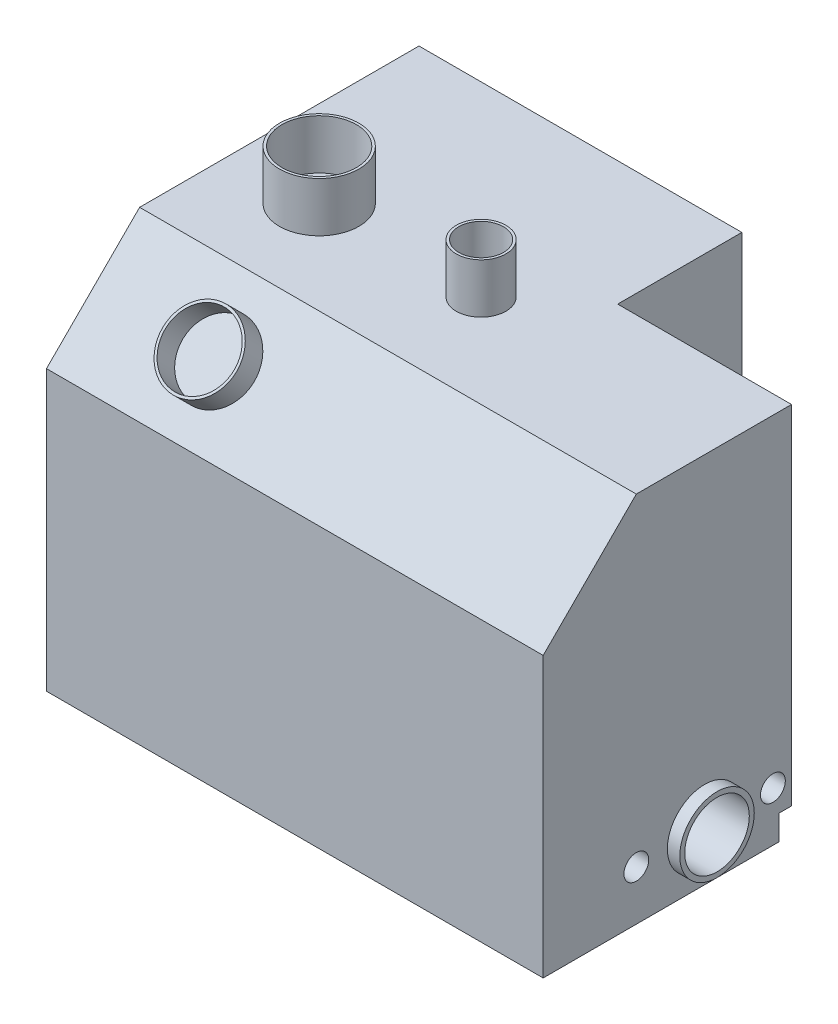
ISO-10303-21;
HEADER;
FILE_DESCRIPTION(('STEP AP214'),'2;1');
FILE_NAME('part.step','',(''),(''),'','','');
FILE_SCHEMA(('AUTOMOTIVE_DESIGN { 1 0 10303 214 1 1 1 1 }'));
ENDSEC;
DATA;
#1=APPLICATION_CONTEXT('core data for automotive mechanical design processes');
#2=APPLICATION_PROTOCOL_DEFINITION('international standard','automotive_design',2000,#1);
#3=PRODUCT_CONTEXT('',#1,'mechanical');
#4=PRODUCT('Part','Part','',(#3));
#5=PRODUCT_RELATED_PRODUCT_CATEGORY('part','',(#4));
#6=PRODUCT_DEFINITION_FORMATION('','',#4);
#7=PRODUCT_DEFINITION_CONTEXT('part definition',#1,'design');
#8=PRODUCT_DEFINITION('design','',#6,#7);
#9=PRODUCT_DEFINITION_SHAPE('','',#8);
#10=(LENGTH_UNIT() NAMED_UNIT(*) SI_UNIT(.MILLI.,.METRE.));
#11=(NAMED_UNIT(*) PLANE_ANGLE_UNIT() SI_UNIT($,.RADIAN.));
#12=(NAMED_UNIT(*) SI_UNIT($,.STERADIAN.) SOLID_ANGLE_UNIT());
#13=UNCERTAINTY_MEASURE_WITH_UNIT(LENGTH_MEASURE(1.E-05),#10,'distance_accuracy_value','');
#14=(GEOMETRIC_REPRESENTATION_CONTEXT(3) GLOBAL_UNCERTAINTY_ASSIGNED_CONTEXT((#13)) GLOBAL_UNIT_ASSIGNED_CONTEXT((#10,
#11,#12)) REPRESENTATION_CONTEXT('',''));
#15=CARTESIAN_POINT('',(0.,0.,0.));
#16=DIRECTION('',(0.,0.,1.));
#17=DIRECTION('',(1.,0.,0.));
#18=AXIS2_PLACEMENT_3D('',#15,#16,#17);
#19=CARTESIAN_POINT('',(-100.,150.,75.));
#20=DIRECTION('',(1.,0.,0.));
#21=DIRECTION('',(0.,0.,-1.));
#22=AXIS2_PLACEMENT_3D('',#19,#20,#21);
#23=PLANE('',#22);
#24=DIRECTION('',(0.,-1.,0.));
#25=VECTOR('',#24,1.);
#26=CARTESIAN_POINT('',(-100.,150.,75.));
#27=LINE('',#26,#25);
#28=CARTESIAN_POINT('',(-100.,112.499999999999,75.));
#29=VERTEX_POINT('',#28);
#30=CARTESIAN_POINT('',(-100.,0.,75.));
#31=VERTEX_POINT('',#30);
#32=EDGE_CURVE('E149',#29,#31,#27,.T.);
#33=ORIENTED_EDGE('',*,*,#32,.F.);
#34=DIRECTION('',(0.,0.707106781186554,-0.707106781186541));
#35=VECTOR('',#34,1.);
#36=CARTESIAN_POINT('',(-100.,150.,37.5));
#37=LINE('',#36,#35);
#38=CARTESIAN_POINT('',(-100.,150.,37.5));
#39=VERTEX_POINT('',#38);
#40=EDGE_CURVE('E200',#29,#39,#37,.T.);
#41=ORIENTED_EDGE('',*,*,#40,.T.);
#42=DIRECTION('',(0.,0.,1.));
#43=VECTOR('',#42,1.);
#44=CARTESIAN_POINT('',(-100.,150.,75.));
#45=LINE('',#44,#43);
#46=CARTESIAN_POINT('',(-100.,150.,-75.));
#47=VERTEX_POINT('',#46);
#48=EDGE_CURVE('E132',#47,#39,#45,.T.);
#49=ORIENTED_EDGE('',*,*,#48,.F.);
#50=DIRECTION('',(0.,-1.,0.));
#51=VECTOR('',#50,1.);
#52=CARTESIAN_POINT('',(-100.,150.,-75.));
#53=LINE('',#52,#51);
#54=CARTESIAN_POINT('',(-100.,0.,-75.));
#55=VERTEX_POINT('',#54);
#56=EDGE_CURVE('E126',#47,#55,#53,.T.);
#57=ORIENTED_EDGE('',*,*,#56,.T.);
#58=DIRECTION('',(0.,0.,1.));
#59=VECTOR('',#58,1.);
#60=CARTESIAN_POINT('',(-100.,0.,75.));
#61=LINE('',#60,#59);
#62=EDGE_CURVE('E136',#55,#31,#61,.T.);
#63=ORIENTED_EDGE('',*,*,#62,.T.);
#64=EDGE_LOOP('',(#33,#41,#49,#57,#63));
#65=FACE_BOUND('',#64,.T.);
#66=ADVANCED_FACE('F34',(#65),#23,.F.);
#67=CARTESIAN_POINT('',(100.,150.,75.));
#68=DIRECTION('',(0.,0.,-1.));
#69=DIRECTION('',(-1.,0.,0.));
#70=AXIS2_PLACEMENT_3D('',#67,#68,#69);
#71=PLANE('',#70);
#72=DIRECTION('',(0.,-1.,0.));
#73=VECTOR('',#72,1.);
#74=CARTESIAN_POINT('',(100.,150.,75.));
#75=LINE('',#74,#73);
#76=CARTESIAN_POINT('',(100.,112.499999999999,75.));
#77=VERTEX_POINT('',#76);
#78=CARTESIAN_POINT('',(100.,0.,75.));
#79=VERTEX_POINT('',#78);
#80=EDGE_CURVE('E130',#77,#79,#75,.T.);
#81=ORIENTED_EDGE('',*,*,#80,.F.);
#82=DIRECTION('',(1.,0.,0.));
#83=VECTOR('',#82,1.);
#84=CARTESIAN_POINT('',(-100.,112.499999999999,75.));
#85=LINE('',#84,#83);
#86=EDGE_CURVE('E206',#29,#77,#85,.T.);
#87=ORIENTED_EDGE('',*,*,#86,.F.);
#88=ORIENTED_EDGE('',*,*,#32,.T.);
#89=DIRECTION('',(1.,0.,0.));
#90=VECTOR('',#89,1.);
#91=CARTESIAN_POINT('',(100.,0.,75.));
#92=LINE('',#91,#90);
#93=EDGE_CURVE('E139',#31,#79,#92,.T.);
#94=ORIENTED_EDGE('',*,*,#93,.T.);
#95=EDGE_LOOP('',(#81,#87,#88,#94));
#96=FACE_BOUND('',#95,.T.);
#97=ADVANCED_FACE('F191',(#96),#71,.F.);
#98=CARTESIAN_POINT('',(100.,150.,75.));
#99=DIRECTION('',(-1.,0.,0.));
#100=DIRECTION('',(0.,0.,1.));
#101=AXIS2_PLACEMENT_3D('',#98,#99,#100);
#102=PLANE('',#101);
#103=CARTESIAN_POINT('',(100.,20.,-17.5));
#104=DIRECTION('',(1.,0.,0.));
#105=DIRECTION('',(0.,0.,1.));
#106=AXIS2_PLACEMENT_3D('',#103,#104,#105);
#107=CIRCLE('',#106,5.);
#108=CARTESIAN_POINT('',(100.,20.,-12.5));
#109=VERTEX_POINT('',#108);
#110=EDGE_CURVE('E235',#109,#109,#107,.T.);
#111=ORIENTED_EDGE('',*,*,#110,.F.);
#112=EDGE_LOOP('',(#111));
#113=FACE_BOUND('',#112,.T.);
#114=CARTESIAN_POINT('',(100.,20.,37.5));
#115=DIRECTION('',(1.,0.,0.));
#116=DIRECTION('',(0.,0.,-1.));
#117=AXIS2_PLACEMENT_3D('',#114,#115,#116);
#118=CIRCLE('',#117,5.);
#119=CARTESIAN_POINT('',(100.,20.,32.5));
#120=VERTEX_POINT('',#119);
#121=EDGE_CURVE('E229',#120,#120,#118,.T.);
#122=ORIENTED_EDGE('',*,*,#121,.F.);
#123=EDGE_LOOP('',(#122));
#124=FACE_BOUND('',#123,.T.);
#125=CARTESIAN_POINT('',(100.,20.,9.99999999999998));
#126=DIRECTION('',(-1.,0.,0.));
#127=DIRECTION('',(0.,0.,1.));
#128=AXIS2_PLACEMENT_3D('',#125,#126,#127);
#129=CIRCLE('',#128,15.);
#130=CARTESIAN_POINT('',(100.,20.,25.));
#131=VERTEX_POINT('',#130);
#132=EDGE_CURVE('E151',#131,#131,#129,.F.);
#133=ORIENTED_EDGE('',*,*,#132,.F.);
#134=EDGE_LOOP('',(#133));
#135=FACE_BOUND('',#134,.T.);
#136=DIRECTION('',(0.,0.,1.));
#137=VECTOR('',#136,1.);
#138=CARTESIAN_POINT('',(100.,10.,-75.));
#139=LINE('',#138,#137);
#140=CARTESIAN_POINT('',(100.,10.,-25.));
#141=VERTEX_POINT('',#140);
#142=CARTESIAN_POINT('',(100.,10.,-20.));
#143=VERTEX_POINT('',#142);
#144=EDGE_CURVE('E223',#141,#143,#139,.T.);
#145=ORIENTED_EDGE('',*,*,#144,.F.);
#146=DIRECTION('',(0.,1.,0.));
#147=VECTOR('',#146,1.);
#148=CARTESIAN_POINT('',(100.,0.,-25.));
#149=LINE('',#148,#147);
#150=CARTESIAN_POINT('',(100.,150.,-25.));
#151=VERTEX_POINT('',#150);
#152=EDGE_CURVE('E311',#141,#151,#149,.T.);
#153=ORIENTED_EDGE('',*,*,#152,.T.);
#154=DIRECTION('',(0.,0.,-1.));
#155=VECTOR('',#154,1.);
#156=CARTESIAN_POINT('',(100.,150.,75.));
#157=LINE('',#156,#155);
#158=CARTESIAN_POINT('',(100.,150.,37.5));
#159=VERTEX_POINT('',#158);
#160=EDGE_CURVE('E128',#159,#151,#157,.T.);
#161=ORIENTED_EDGE('',*,*,#160,.F.);
#162=DIRECTION('',(0.,0.707106781186554,-0.707106781186541));
#163=VECTOR('',#162,1.);
#164=CARTESIAN_POINT('',(100.,150.,37.5));
#165=LINE('',#164,#163);
#166=EDGE_CURVE('E56',#77,#159,#165,.T.);
#167=ORIENTED_EDGE('',*,*,#166,.F.);
#168=ORIENTED_EDGE('',*,*,#80,.T.);
#169=DIRECTION('',(0.,0.,-1.));
#170=VECTOR('',#169,1.);
#171=CARTESIAN_POINT('',(100.,0.,75.));
#172=LINE('',#171,#170);
#173=CARTESIAN_POINT('',(100.,0.,-20.));
#174=VERTEX_POINT('',#173);
#175=EDGE_CURVE('E143',#79,#174,#172,.T.);
#176=ORIENTED_EDGE('',*,*,#175,.T.);
#177=DIRECTION('',(0.,-1.,0.));
#178=VECTOR('',#177,1.);
#179=CARTESIAN_POINT('',(100.,0.,-20.));
#180=LINE('',#179,#178);
#181=EDGE_CURVE('E113',#143,#174,#180,.T.);
#182=ORIENTED_EDGE('',*,*,#181,.F.);
#183=EDGE_LOOP('',(#145,#153,#161,#167,#168,#176,#182));
#184=FACE_BOUND('',#183,.T.);
#185=ADVANCED_FACE('F196',(#113,#124,#135,#184),#102,.F.);
#186=CARTESIAN_POINT('',(100.,150.,-75.));
#187=DIRECTION('',(0.,0.,1.));
#188=DIRECTION('',(1.,0.,0.));
#189=AXIS2_PLACEMENT_3D('',#186,#187,#188);
#190=PLANE('',#189);
#191=DIRECTION('',(-1.,0.,0.));
#192=VECTOR('',#191,1.);
#193=CARTESIAN_POINT('',(100.,150.,-75.));
#194=LINE('',#193,#192);
#195=CARTESIAN_POINT('',(30.,150.,-75.));
#196=VERTEX_POINT('',#195);
#197=EDGE_CURVE('E119',#196,#47,#194,.T.);
#198=ORIENTED_EDGE('',*,*,#197,.F.);
#199=DIRECTION('',(0.,1.,0.));
#200=VECTOR('',#199,1.);
#201=CARTESIAN_POINT('',(30.,10.,-75.));
#202=LINE('',#201,#200);
#203=CARTESIAN_POINT('',(30.,0.,-75.));
#204=VERTEX_POINT('',#203);
#205=EDGE_CURVE('E102',#204,#196,#202,.T.);
#206=ORIENTED_EDGE('',*,*,#205,.F.);
#207=DIRECTION('',(-1.,0.,0.));
#208=VECTOR('',#207,1.);
#209=CARTESIAN_POINT('',(100.,0.,-75.));
#210=LINE('',#209,#208);
#211=EDGE_CURVE('E146',#204,#55,#210,.T.);
#212=ORIENTED_EDGE('',*,*,#211,.T.);
#213=ORIENTED_EDGE('',*,*,#56,.F.);
#214=EDGE_LOOP('',(#198,#206,#212,#213));
#215=FACE_BOUND('',#214,.T.);
#216=ADVANCED_FACE('F124',(#215),#190,.F.);
#217=CARTESIAN_POINT('',(0.,150.,0.));
#218=DIRECTION('',(0.,1.,0.));
#219=DIRECTION('',(0.,0.,1.));
#220=AXIS2_PLACEMENT_3D('',#217,#218,#219);
#221=PLANE('',#220);
#222=DIRECTION('',(1.,0.,0.));
#223=VECTOR('',#222,1.);
#224=CARTESIAN_POINT('',(100.,150.,-25.));
#225=LINE('',#224,#223);
#226=CARTESIAN_POINT('',(30.,150.,-25.));
#227=VERTEX_POINT('',#226);
#228=EDGE_CURVE('E122',#227,#151,#225,.T.);
#229=ORIENTED_EDGE('',*,*,#228,.F.);
#230=DIRECTION('',(0.,0.,1.));
#231=VECTOR('',#230,1.);
#232=CARTESIAN_POINT('',(30.,150.,-75.));
#233=LINE('',#232,#231);
#234=EDGE_CURVE('E105',#196,#227,#233,.T.);
#235=ORIENTED_EDGE('',*,*,#234,.F.);
#236=ORIENTED_EDGE('',*,*,#197,.T.);
#237=ORIENTED_EDGE('',*,*,#48,.T.);
#238=DIRECTION('',(1.,0.,0.));
#239=VECTOR('',#238,1.);
#240=CARTESIAN_POINT('',(-100.,150.,37.5));
#241=LINE('',#240,#239);
#242=EDGE_CURVE('E221',#39,#159,#241,.T.);
#243=ORIENTED_EDGE('',*,*,#242,.T.);
#244=ORIENTED_EDGE('',*,*,#160,.T.);
#245=EDGE_LOOP('',(#229,#235,#236,#237,#243,#244));
#246=FACE_BOUND('',#245,.T.);
#247=CARTESIAN_POINT('',(-65.1960375674245,150.,0.));
#248=DIRECTION('',(0.,1.,0.));
#249=DIRECTION('',(0.,0.,1.));
#250=AXIS2_PLACEMENT_3D('',#247,#248,#249);
#251=CIRCLE('',#250,16.);
#252=CARTESIAN_POINT('',(-65.1960375674245,150.,16.));
#253=VERTEX_POINT('',#252);
#254=EDGE_CURVE('E303',#253,#253,#251,.T.);
#255=ORIENTED_EDGE('',*,*,#254,.F.);
#256=EDGE_LOOP('',(#255));
#257=FACE_BOUND('',#256,.T.);
#258=CARTESIAN_POINT('',(0.,150.,0.));
#259=DIRECTION('',(0.,1.,0.));
#260=DIRECTION('',(0.,0.,1.));
#261=AXIS2_PLACEMENT_3D('',#258,#259,#260);
#262=CIRCLE('',#261,10.);
#263=CARTESIAN_POINT('',(0.,150.,10.));
#264=VERTEX_POINT('',#263);
#265=EDGE_CURVE('E294',#264,#264,#262,.T.);
#266=ORIENTED_EDGE('',*,*,#265,.F.);
#267=EDGE_LOOP('',(#266));
#268=FACE_BOUND('',#267,.T.);
#269=ADVANCED_FACE('F116',(#246,#257,#268),#221,.T.);
#270=CARTESIAN_POINT('',(0.,0.,0.));
#271=DIRECTION('',(0.,1.,0.));
#272=DIRECTION('',(0.,0.,1.));
#273=AXIS2_PLACEMENT_3D('',#270,#271,#272);
#274=PLANE('',#273);
#275=DIRECTION('',(0.,0.,-1.));
#276=VECTOR('',#275,1.);
#277=CARTESIAN_POINT('',(30.,0.,0.));
#278=LINE('',#277,#276);
#279=CARTESIAN_POINT('',(30.,0.,-20.));
#280=VERTEX_POINT('',#279);
#281=EDGE_CURVE('E108',#280,#204,#278,.T.);
#282=ORIENTED_EDGE('',*,*,#281,.F.);
#283=DIRECTION('',(1.,0.,0.));
#284=VECTOR('',#283,1.);
#285=CARTESIAN_POINT('',(0.,0.,-20.));
#286=LINE('',#285,#284);
#287=EDGE_CURVE('E155',#280,#174,#286,.T.);
#288=ORIENTED_EDGE('',*,*,#287,.T.);
#289=ORIENTED_EDGE('',*,*,#175,.F.);
#290=ORIENTED_EDGE('',*,*,#93,.F.);
#291=ORIENTED_EDGE('',*,*,#62,.F.);
#292=ORIENTED_EDGE('',*,*,#211,.F.);
#293=EDGE_LOOP('',(#282,#288,#289,#290,#291,#292));
#294=FACE_BOUND('',#293,.T.);
#295=ADVANCED_FACE('F189',(#294),#274,.F.);
#296=CARTESIAN_POINT('',(105.,20.,9.99999999999998));
#297=DIRECTION('',(1.,0.,0.));
#298=DIRECTION('',(0.,0.,-1.));
#299=AXIS2_PLACEMENT_3D('',#296,#297,#298);
#300=PLANE('',#299);
#301=CARTESIAN_POINT('',(105.,20.,9.99999999999998));
#302=DIRECTION('',(1.,0.,0.));
#303=DIRECTION('',(0.,0.,-1.));
#304=AXIS2_PLACEMENT_3D('',#301,#302,#303);
#305=CIRCLE('',#304,15.);
#306=CARTESIAN_POINT('',(105.,20.,-5.00000000000002));
#307=VERTEX_POINT('',#306);
#308=EDGE_CURVE('E140',#307,#307,#305,.T.);
#309=ORIENTED_EDGE('',*,*,#308,.T.);
#310=EDGE_LOOP('',(#309));
#311=FACE_BOUND('',#310,.T.);
#312=CARTESIAN_POINT('',(105.,20.,9.99999999999998));
#313=DIRECTION('',(1.,0.,0.));
#314=DIRECTION('',(0.,0.,-1.));
#315=AXIS2_PLACEMENT_3D('',#312,#313,#314);
#316=CIRCLE('',#315,13.);
#317=CARTESIAN_POINT('',(105.,20.,-3.00000000000002));
#318=VERTEX_POINT('',#317);
#319=EDGE_CURVE('E248',#318,#318,#316,.T.);
#320=ORIENTED_EDGE('',*,*,#319,.F.);
#321=EDGE_LOOP('',(#320));
#322=FACE_BOUND('',#321,.T.);
#323=ADVANCED_FACE('F337',(#311,#322),#300,.T.);
#324=CARTESIAN_POINT('',(105.,20.,9.99999999999998));
#325=DIRECTION('',(-1.,0.,0.));
#326=DIRECTION('',(0.,0.,1.));
#327=AXIS2_PLACEMENT_3D('',#324,#325,#326);
#328=CYLINDRICAL_SURFACE('',#327,15.);
#329=ORIENTED_EDGE('',*,*,#308,.F.);
#330=EDGE_LOOP('',(#329));
#331=FACE_BOUND('',#330,.T.);
#332=ORIENTED_EDGE('',*,*,#132,.T.);
#333=EDGE_LOOP('',(#332));
#334=FACE_BOUND('',#333,.T.);
#335=ADVANCED_FACE('F329',(#331,#334),#328,.T.);
#336=CARTESIAN_POINT('',(105.,20.,9.99999999999998));
#337=DIRECTION('',(-1.,0.,0.));
#338=DIRECTION('',(0.,0.,1.));
#339=AXIS2_PLACEMENT_3D('',#336,#337,#338);
#340=CYLINDRICAL_SURFACE('',#339,13.);
#341=ORIENTED_EDGE('',*,*,#319,.T.);
#342=EDGE_LOOP('',(#341));
#343=FACE_BOUND('',#342,.T.);
#344=CARTESIAN_POINT('',(30.,20.,9.99999999999998));
#345=DIRECTION('',(1.,0.,0.));
#346=DIRECTION('',(0.,0.,-1.));
#347=AXIS2_PLACEMENT_3D('',#344,#345,#346);
#348=CIRCLE('',#347,13.);
#349=CARTESIAN_POINT('',(30.,20.,-3.00000000000002));
#350=VERTEX_POINT('',#349);
#351=EDGE_CURVE('E228',#350,#350,#348,.T.);
#352=ORIENTED_EDGE('',*,*,#351,.F.);
#353=EDGE_LOOP('',(#352));
#354=FACE_BOUND('',#353,.T.);
#355=ADVANCED_FACE('F322',(#343,#354),#340,.F.);
#356=CARTESIAN_POINT('',(30.,0.,-20.));
#357=DIRECTION('',(0.,0.,1.));
#358=DIRECTION('',(0.,-1.,0.));
#359=AXIS2_PLACEMENT_3D('',#356,#357,#358);
#360=PLANE('',#359);
#361=DIRECTION('',(0.,-1.,0.));
#362=VECTOR('',#361,1.);
#363=CARTESIAN_POINT('',(30.,10.,-20.));
#364=LINE('',#363,#362);
#365=CARTESIAN_POINT('',(30.,10.,-20.));
#366=VERTEX_POINT('',#365);
#367=EDGE_CURVE('E240',#366,#280,#364,.T.);
#368=ORIENTED_EDGE('',*,*,#367,.F.);
#369=DIRECTION('',(1.,0.,0.));
#370=VECTOR('',#369,1.);
#371=CARTESIAN_POINT('',(30.,10.,-20.));
#372=LINE('',#371,#370);
#373=EDGE_CURVE('E237',#366,#143,#372,.T.);
#374=ORIENTED_EDGE('',*,*,#373,.T.);
#375=ORIENTED_EDGE('',*,*,#181,.T.);
#376=ORIENTED_EDGE('',*,*,#287,.F.);
#377=EDGE_LOOP('',(#368,#374,#375,#376));
#378=FACE_BOUND('',#377,.T.);
#379=ADVANCED_FACE('F320',(#378),#360,.F.);
#380=CARTESIAN_POINT('',(30.,0.,0.));
#381=DIRECTION('',(1.,0.,0.));
#382=DIRECTION('',(0.,0.,-1.));
#383=AXIS2_PLACEMENT_3D('',#380,#381,#382);
#384=PLANE('',#383);
#385=ORIENTED_EDGE('',*,*,#281,.T.);
#386=ORIENTED_EDGE('',*,*,#205,.T.);
#387=ORIENTED_EDGE('',*,*,#234,.T.);
#388=DIRECTION('',(0.,1.,0.));
#389=VECTOR('',#388,1.);
#390=CARTESIAN_POINT('',(30.,0.,-25.));
#391=LINE('',#390,#389);
#392=CARTESIAN_POINT('',(30.,10.,-25.));
#393=VERTEX_POINT('',#392);
#394=EDGE_CURVE('E48',#393,#227,#391,.T.);
#395=ORIENTED_EDGE('',*,*,#394,.F.);
#396=DIRECTION('',(0.,0.,1.));
#397=VECTOR('',#396,1.);
#398=CARTESIAN_POINT('',(30.,10.,-75.));
#399=LINE('',#398,#397);
#400=EDGE_CURVE('E112',#393,#366,#399,.T.);
#401=ORIENTED_EDGE('',*,*,#400,.T.);
#402=ORIENTED_EDGE('',*,*,#367,.T.);
#403=EDGE_LOOP('',(#385,#386,#387,#395,#401,#402));
#404=FACE_BOUND('',#403,.T.);
#405=ADVANCED_FACE('F104',(#404),#384,.T.);
#406=CARTESIAN_POINT('',(30.,10.,-75.));
#407=DIRECTION('',(0.,1.,0.));
#408=DIRECTION('',(0.,0.,1.));
#409=AXIS2_PLACEMENT_3D('',#406,#407,#408);
#410=PLANE('',#409);
#411=ORIENTED_EDGE('',*,*,#400,.F.);
#412=DIRECTION('',(1.,0.,0.));
#413=VECTOR('',#412,1.);
#414=CARTESIAN_POINT('',(30.,10.,-25.));
#415=LINE('',#414,#413);
#416=EDGE_CURVE('E11',#393,#141,#415,.T.);
#417=ORIENTED_EDGE('',*,*,#416,.T.);
#418=ORIENTED_EDGE('',*,*,#144,.T.);
#419=ORIENTED_EDGE('',*,*,#373,.F.);
#420=EDGE_LOOP('',(#411,#417,#418,#419));
#421=FACE_BOUND('',#420,.T.);
#422=ADVANCED_FACE('F317',(#421),#410,.F.);
#423=CARTESIAN_POINT('',(30.,20.,37.5));
#424=DIRECTION('',(1.,0.,0.));
#425=DIRECTION('',(0.,0.,-1.));
#426=AXIS2_PLACEMENT_3D('',#423,#424,#425);
#427=CYLINDRICAL_SURFACE('',#426,5.);
#428=CARTESIAN_POINT('',(30.,20.,37.5));
#429=DIRECTION('',(1.,0.,0.));
#430=DIRECTION('',(0.,0.,-1.));
#431=AXIS2_PLACEMENT_3D('',#428,#429,#430);
#432=CIRCLE('',#431,5.);
#433=CARTESIAN_POINT('',(30.,20.,32.5));
#434=VERTEX_POINT('',#433);
#435=EDGE_CURVE('E225',#434,#434,#432,.T.);
#436=ORIENTED_EDGE('',*,*,#435,.F.);
#437=EDGE_LOOP('',(#436));
#438=FACE_BOUND('',#437,.T.);
#439=ORIENTED_EDGE('',*,*,#121,.T.);
#440=EDGE_LOOP('',(#439));
#441=FACE_BOUND('',#440,.T.);
#442=ADVANCED_FACE('F335',(#438,#441),#427,.F.);
#443=CARTESIAN_POINT('',(30.,20.,37.5));
#444=DIRECTION('',(1.,0.,0.));
#445=DIRECTION('',(0.,0.,-1.));
#446=AXIS2_PLACEMENT_3D('',#443,#444,#445);
#447=PLANE('',#446);
#448=ORIENTED_EDGE('',*,*,#435,.T.);
#449=EDGE_LOOP('',(#448));
#450=FACE_BOUND('',#449,.T.);
#451=ADVANCED_FACE('F393',(#450),#447,.T.);
#452=CARTESIAN_POINT('',(30.,20.,-17.5));
#453=DIRECTION('',(1.,0.,0.));
#454=DIRECTION('',(0.,0.,-1.));
#455=AXIS2_PLACEMENT_3D('',#452,#453,#454);
#456=CYLINDRICAL_SURFACE('',#455,5.);
#457=CARTESIAN_POINT('',(30.,20.,-17.5));
#458=DIRECTION('',(1.,0.,0.));
#459=DIRECTION('',(0.,0.,1.));
#460=AXIS2_PLACEMENT_3D('',#457,#458,#459);
#461=CIRCLE('',#460,5.);
#462=CARTESIAN_POINT('',(30.,20.,-12.5));
#463=VERTEX_POINT('',#462);
#464=EDGE_CURVE('E232',#463,#463,#461,.T.);
#465=ORIENTED_EDGE('',*,*,#464,.F.);
#466=EDGE_LOOP('',(#465));
#467=FACE_BOUND('',#466,.T.);
#468=ORIENTED_EDGE('',*,*,#110,.T.);
#469=EDGE_LOOP('',(#468));
#470=FACE_BOUND('',#469,.T.);
#471=ADVANCED_FACE('F404',(#467,#470),#456,.F.);
#472=CARTESIAN_POINT('',(30.,20.,-17.5));
#473=DIRECTION('',(-1.,0.,0.));
#474=DIRECTION('',(0.,0.,1.));
#475=AXIS2_PLACEMENT_3D('',#472,#473,#474);
#476=PLANE('',#475);
#477=ORIENTED_EDGE('',*,*,#464,.T.);
#478=EDGE_LOOP('',(#477));
#479=FACE_BOUND('',#478,.T.);
#480=ADVANCED_FACE('F266',(#479),#476,.F.);
#481=CARTESIAN_POINT('',(30.,20.,9.99999999999998));
#482=DIRECTION('',(1.,0.,0.));
#483=DIRECTION('',(0.,0.,-1.));
#484=AXIS2_PLACEMENT_3D('',#481,#482,#483);
#485=PLANE('',#484);
#486=ORIENTED_EDGE('',*,*,#351,.T.);
#487=EDGE_LOOP('',(#486));
#488=FACE_BOUND('',#487,.T.);
#489=ADVANCED_FACE('F255',(#488),#485,.T.);
#490=CARTESIAN_POINT('',(-100.,150.,37.5));
#491=DIRECTION('',(0.,-0.707106781186541,-0.707106781186554));
#492=DIRECTION('',(0.,0.707106781186554,-0.707106781186541));
#493=AXIS2_PLACEMENT_3D('',#490,#491,#492);
#494=PLANE('',#493);
#495=CARTESIAN_POINT('',(-50.,131.249999999999,56.2500000000004));
#496=DIRECTION('',(0.,-0.707106781186541,-0.707106781186554));
#497=DIRECTION('',(0.,0.707106781186554,-0.707106781186541));
#498=AXIS2_PLACEMENT_3D('',#495,#496,#497);
#499=CIRCLE('',#498,15.);
#500=CARTESIAN_POINT('',(-50.,141.856601717798,45.6433982822023));
#501=VERTEX_POINT('',#500);
#502=EDGE_CURVE('E158',#501,#501,#499,.F.);
#503=ORIENTED_EDGE('',*,*,#502,.F.);
#504=EDGE_LOOP('',(#503));
#505=FACE_BOUND('',#504,.T.);
#506=ORIENTED_EDGE('',*,*,#166,.T.);
#507=ORIENTED_EDGE('',*,*,#242,.F.);
#508=ORIENTED_EDGE('',*,*,#40,.F.);
#509=ORIENTED_EDGE('',*,*,#86,.T.);
#510=EDGE_LOOP('',(#506,#507,#508,#509));
#511=FACE_BOUND('',#510,.T.);
#512=ADVANCED_FACE('F252',(#505,#511),#494,.F.);
#513=CARTESIAN_POINT('',(-50.,138.321067811865,63.321067811866));
#514=DIRECTION('',(0.,0.707106781186542,0.707106781186554));
#515=DIRECTION('',(0.,-0.707106781186554,0.707106781186542));
#516=AXIS2_PLACEMENT_3D('',#513,#514,#515);
#517=PLANE('',#516);
#518=CARTESIAN_POINT('',(-50.,138.321067811865,63.321067811866));
#519=DIRECTION('',(0.,0.707106781186542,0.707106781186554));
#520=DIRECTION('',(0.,-0.707106781186554,0.707106781186542));
#521=AXIS2_PLACEMENT_3D('',#518,#519,#520);
#522=CIRCLE('',#521,15.);
#523=CARTESIAN_POINT('',(-50.,127.714466094066,73.9276695296641));
#524=VERTEX_POINT('',#523);
#525=EDGE_CURVE('E214',#524,#524,#522,.T.);
#526=ORIENTED_EDGE('',*,*,#525,.T.);
#527=EDGE_LOOP('',(#526));
#528=FACE_BOUND('',#527,.T.);
#529=CARTESIAN_POINT('',(-50.,138.321067811865,63.321067811866));
#530=DIRECTION('',(0.,0.707106781186542,0.707106781186554));
#531=DIRECTION('',(0.,-0.707106781186554,0.707106781186542));
#532=AXIS2_PLACEMENT_3D('',#529,#530,#531);
#533=CIRCLE('',#532,14.);
#534=CARTESIAN_POINT('',(-50.,128.421572875253,73.2205627484776));
#535=VERTEX_POINT('',#534);
#536=EDGE_CURVE('E218',#535,#535,#533,.T.);
#537=ORIENTED_EDGE('',*,*,#536,.F.);
#538=EDGE_LOOP('',(#537));
#539=FACE_BOUND('',#538,.T.);
#540=ADVANCED_FACE('F254',(#528,#539),#517,.T.);
#541=CARTESIAN_POINT('',(-50.,138.321067811865,63.321067811866));
#542=DIRECTION('',(0.,-0.707106781186542,-0.707106781186554));
#543=DIRECTION('',(0.,0.707106781186554,-0.707106781186542));
#544=AXIS2_PLACEMENT_3D('',#541,#542,#543);
#545=CYLINDRICAL_SURFACE('',#544,15.);
#546=ORIENTED_EDGE('',*,*,#525,.F.);
#547=EDGE_LOOP('',(#546));
#548=FACE_BOUND('',#547,.T.);
#549=ORIENTED_EDGE('',*,*,#502,.T.);
#550=EDGE_LOOP('',(#549));
#551=FACE_BOUND('',#550,.T.);
#552=ADVANCED_FACE('F263',(#548,#551),#545,.T.);
#553=CARTESIAN_POINT('',(-50.,138.321067811865,63.321067811866));
#554=DIRECTION('',(0.,-0.707106781186542,-0.707106781186554));
#555=DIRECTION('',(0.,0.707106781186554,-0.707106781186542));
#556=AXIS2_PLACEMENT_3D('',#553,#554,#555);
#557=CYLINDRICAL_SURFACE('',#556,14.);
#558=ORIENTED_EDGE('',*,*,#536,.T.);
#559=EDGE_LOOP('',(#558));
#560=FACE_BOUND('',#559,.T.);
#561=CARTESIAN_POINT('',(-50.,131.249999999999,56.2500000000005));
#562=DIRECTION('',(0.,0.707106781186542,0.707106781186554));
#563=DIRECTION('',(0.,-0.707106781186554,0.707106781186542));
#564=AXIS2_PLACEMENT_3D('',#561,#562,#563);
#565=CIRCLE('',#564,14.);
#566=CARTESIAN_POINT('',(-50.,121.350505063387,66.149494936612));
#567=VERTEX_POINT('',#566);
#568=EDGE_CURVE('E287',#567,#567,#565,.T.);
#569=ORIENTED_EDGE('',*,*,#568,.F.);
#570=EDGE_LOOP('',(#569));
#571=FACE_BOUND('',#570,.T.);
#572=ADVANCED_FACE('F274',(#560,#571),#557,.F.);
#573=ORIENTED_EDGE('',*,*,#568,.T.);
#574=EDGE_LOOP('',(#573));
#575=FACE_BOUND('',#574,.T.);
#576=ADVANCED_FACE('F258',(#575),#494,.F.);
#577=CARTESIAN_POINT('',(0.,170.,0.));
#578=DIRECTION('',(0.,1.,0.));
#579=DIRECTION('',(0.,0.,1.));
#580=AXIS2_PLACEMENT_3D('',#577,#578,#579);
#581=PLANE('',#580);
#582=CARTESIAN_POINT('',(0.,170.,0.));
#583=DIRECTION('',(0.,1.,0.));
#584=DIRECTION('',(0.,0.,1.));
#585=AXIS2_PLACEMENT_3D('',#582,#583,#584);
#586=CIRCLE('',#585,10.);
#587=CARTESIAN_POINT('',(0.,170.,10.));
#588=VERTEX_POINT('',#587);
#589=EDGE_CURVE('E289',#588,#588,#586,.T.);
#590=ORIENTED_EDGE('',*,*,#589,.T.);
#591=EDGE_LOOP('',(#590));
#592=FACE_BOUND('',#591,.T.);
#593=CARTESIAN_POINT('',(0.,170.,0.));
#594=DIRECTION('',(0.,1.,0.));
#595=DIRECTION('',(0.,0.,1.));
#596=AXIS2_PLACEMENT_3D('',#593,#594,#595);
#597=CIRCLE('',#596,9.);
#598=CARTESIAN_POINT('',(0.,170.,9.));
#599=VERTEX_POINT('',#598);
#600=EDGE_CURVE('E298',#599,#599,#597,.T.);
#601=ORIENTED_EDGE('',*,*,#600,.F.);
#602=EDGE_LOOP('',(#601));
#603=FACE_BOUND('',#602,.T.);
#604=ADVANCED_FACE('F273',(#592,#603),#581,.T.);
#605=CARTESIAN_POINT('',(0.,170.,0.));
#606=DIRECTION('',(0.,-1.,0.));
#607=DIRECTION('',(0.,0.,-1.));
#608=AXIS2_PLACEMENT_3D('',#605,#606,#607);
#609=CYLINDRICAL_SURFACE('',#608,10.);
#610=ORIENTED_EDGE('',*,*,#589,.F.);
#611=EDGE_LOOP('',(#610));
#612=FACE_BOUND('',#611,.T.);
#613=ORIENTED_EDGE('',*,*,#265,.T.);
#614=EDGE_LOOP('',(#613));
#615=FACE_BOUND('',#614,.T.);
#616=ADVANCED_FACE('F280',(#612,#615),#609,.T.);
#617=CARTESIAN_POINT('',(0.,170.,0.));
#618=DIRECTION('',(0.,-1.,0.));
#619=DIRECTION('',(0.,0.,-1.));
#620=AXIS2_PLACEMENT_3D('',#617,#618,#619);
#621=CYLINDRICAL_SURFACE('',#620,9.);
#622=ORIENTED_EDGE('',*,*,#600,.T.);
#623=EDGE_LOOP('',(#622));
#624=FACE_BOUND('',#623,.T.);
#625=CARTESIAN_POINT('',(0.,150.,0.));
#626=DIRECTION('',(0.,1.,0.));
#627=DIRECTION('',(0.,0.,1.));
#628=AXIS2_PLACEMENT_3D('',#625,#626,#627);
#629=CIRCLE('',#628,9.);
#630=CARTESIAN_POINT('',(0.,150.,9.));
#631=VERTEX_POINT('',#630);
#632=EDGE_CURVE('E161',#631,#631,#629,.F.);
#633=ORIENTED_EDGE('',*,*,#632,.T.);
#634=EDGE_LOOP('',(#633));
#635=FACE_BOUND('',#634,.T.);
#636=ADVANCED_FACE('F186',(#624,#635),#621,.F.);
#637=ORIENTED_EDGE('',*,*,#632,.F.);
#638=EDGE_LOOP('',(#637));
#639=FACE_BOUND('',#638,.T.);
#640=ADVANCED_FACE('F172',(#639),#221,.T.);
#641=CARTESIAN_POINT('',(-65.1960375674245,170.,0.));
#642=DIRECTION('',(0.,1.,0.));
#643=DIRECTION('',(0.,0.,1.));
#644=AXIS2_PLACEMENT_3D('',#641,#642,#643);
#645=PLANE('',#644);
#646=CARTESIAN_POINT('',(-65.1960375674245,170.,0.));
#647=DIRECTION('',(0.,1.,0.));
#648=DIRECTION('',(0.,0.,1.));
#649=AXIS2_PLACEMENT_3D('',#646,#647,#648);
#650=CIRCLE('',#649,16.);
#651=CARTESIAN_POINT('',(-65.1960375674245,170.,16.));
#652=VERTEX_POINT('',#651);
#653=EDGE_CURVE('E302',#652,#652,#650,.T.);
#654=ORIENTED_EDGE('',*,*,#653,.T.);
#655=EDGE_LOOP('',(#654));
#656=FACE_BOUND('',#655,.T.);
#657=CARTESIAN_POINT('',(-65.1960375674245,170.,0.));
#658=DIRECTION('',(0.,1.,0.));
#659=DIRECTION('',(0.,0.,1.));
#660=AXIS2_PLACEMENT_3D('',#657,#658,#659);
#661=CIRCLE('',#660,15.);
#662=CARTESIAN_POINT('',(-65.1960375674245,170.,15.));
#663=VERTEX_POINT('',#662);
#664=EDGE_CURVE('E306',#663,#663,#661,.T.);
#665=ORIENTED_EDGE('',*,*,#664,.F.);
#666=EDGE_LOOP('',(#665));
#667=FACE_BOUND('',#666,.T.);
#668=ADVANCED_FACE('F185',(#656,#667),#645,.T.);
#669=CARTESIAN_POINT('',(-65.1960375674245,170.,0.));
#670=DIRECTION('',(0.,-1.,0.));
#671=DIRECTION('',(0.,0.,-1.));
#672=AXIS2_PLACEMENT_3D('',#669,#670,#671);
#673=CYLINDRICAL_SURFACE('',#672,16.);
#674=ORIENTED_EDGE('',*,*,#653,.F.);
#675=EDGE_LOOP('',(#674));
#676=FACE_BOUND('',#675,.T.);
#677=ORIENTED_EDGE('',*,*,#254,.T.);
#678=EDGE_LOOP('',(#677));
#679=FACE_BOUND('',#678,.T.);
#680=ADVANCED_FACE('F179',(#676,#679),#673,.T.);
#681=CARTESIAN_POINT('',(-65.1960375674245,170.,0.));
#682=DIRECTION('',(0.,-1.,0.));
#683=DIRECTION('',(0.,0.,-1.));
#684=AXIS2_PLACEMENT_3D('',#681,#682,#683);
#685=CYLINDRICAL_SURFACE('',#684,15.);
#686=ORIENTED_EDGE('',*,*,#664,.T.);
#687=EDGE_LOOP('',(#686));
#688=FACE_BOUND('',#687,.T.);
#689=CARTESIAN_POINT('',(-65.1960375674245,150.,0.));
#690=DIRECTION('',(0.,1.,0.));
#691=DIRECTION('',(0.,0.,1.));
#692=AXIS2_PLACEMENT_3D('',#689,#690,#691);
#693=CIRCLE('',#692,15.);
#694=CARTESIAN_POINT('',(-65.1960375674245,150.,15.));
#695=VERTEX_POINT('',#694);
#696=EDGE_CURVE('E41',#695,#695,#693,.F.);
#697=ORIENTED_EDGE('',*,*,#696,.T.);
#698=EDGE_LOOP('',(#697));
#699=FACE_BOUND('',#698,.T.);
#700=ADVANCED_FACE('F166',(#688,#699),#685,.F.);
#701=ORIENTED_EDGE('',*,*,#696,.F.);
#702=EDGE_LOOP('',(#701));
#703=FACE_BOUND('',#702,.T.);
#704=ADVANCED_FACE('F168',(#703),#221,.T.);
#705=CARTESIAN_POINT('',(100.,0.,-25.));
#706=DIRECTION('',(0.,0.,1.));
#707=DIRECTION('',(1.,0.,0.));
#708=AXIS2_PLACEMENT_3D('',#705,#706,#707);
#709=PLANE('',#708);
#710=ORIENTED_EDGE('',*,*,#394,.T.);
#711=ORIENTED_EDGE('',*,*,#228,.T.);
#712=ORIENTED_EDGE('',*,*,#152,.F.);
#713=ORIENTED_EDGE('',*,*,#416,.F.);
#714=EDGE_LOOP('',(#710,#711,#712,#713));
#715=FACE_BOUND('',#714,.T.);
#716=ADVANCED_FACE('F170',(#715),#709,.F.);
#717=CLOSED_SHELL('',(#66,#97,#185,#216,#269,#295,#323,#335,#355,#379,#405,#422,#442,#451,#471,
#480,#489,#512,#540,#552,#572,#576,#604,#616,#636,#640,#668,#680,#700,#704,#716));
#718=MANIFOLD_SOLID_BREP('B2',#717);
#719=ADVANCED_BREP_SHAPE_REPRESENTATION('',(#18,#718),#14);
#720=SHAPE_DEFINITION_REPRESENTATION(#9,#719);
ENDSEC;
END-ISO-10303-21;
